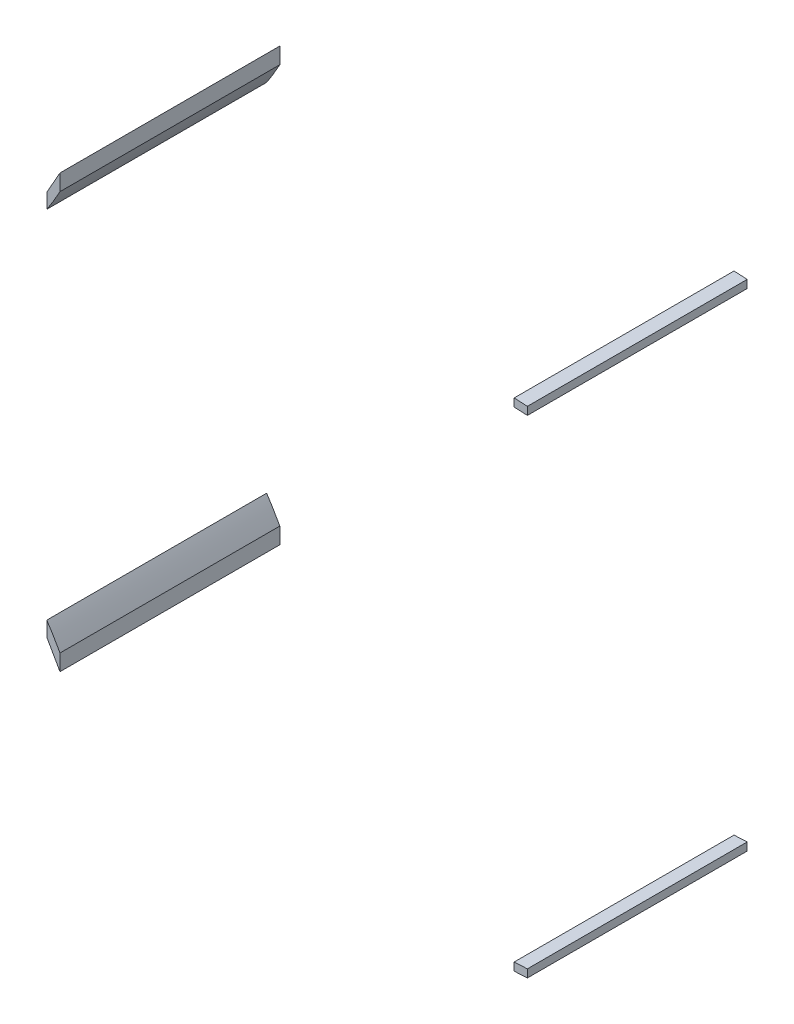
ISO-10303-21;
HEADER;
FILE_DESCRIPTION(('STEP AP214'),'2;1');
FILE_NAME('part.step','',(''),(''),'','','');
FILE_SCHEMA(('AUTOMOTIVE_DESIGN { 1 0 10303 214 1 1 1 1 }'));
ENDSEC;
DATA;
#1=APPLICATION_CONTEXT('core data for automotive mechanical design processes');
#2=APPLICATION_PROTOCOL_DEFINITION('international standard','automotive_design',2000,#1);
#3=PRODUCT_CONTEXT('',#1,'mechanical');
#4=PRODUCT('Part','Part','',(#3));
#5=PRODUCT_RELATED_PRODUCT_CATEGORY('part','',(#4));
#6=PRODUCT_DEFINITION_FORMATION('','',#4);
#7=PRODUCT_DEFINITION_CONTEXT('part definition',#1,'design');
#8=PRODUCT_DEFINITION('design','',#6,#7);
#9=PRODUCT_DEFINITION_SHAPE('','',#8);
#10=(LENGTH_UNIT() NAMED_UNIT(*) SI_UNIT(.MILLI.,.METRE.));
#11=(NAMED_UNIT(*) PLANE_ANGLE_UNIT() SI_UNIT($,.RADIAN.));
#12=(NAMED_UNIT(*) SI_UNIT($,.STERADIAN.) SOLID_ANGLE_UNIT());
#13=UNCERTAINTY_MEASURE_WITH_UNIT(LENGTH_MEASURE(1.E-05),#10,'distance_accuracy_value','');
#14=(GEOMETRIC_REPRESENTATION_CONTEXT(3) GLOBAL_UNCERTAINTY_ASSIGNED_CONTEXT((#13)) GLOBAL_UNIT_ASSIGNED_CONTEXT((#10,
#11,#12)) REPRESENTATION_CONTEXT('',''));
#15=CARTESIAN_POINT('',(0.,0.,0.));
#16=DIRECTION('',(0.,0.,1.));
#17=DIRECTION('',(1.,0.,0.));
#18=AXIS2_PLACEMENT_3D('',#15,#16,#17);
#19=CARTESIAN_POINT('',(-95.6973933556594,36.012725375374,50.));
#20=CARTESIAN_POINT('',(-94.6090631527935,37.6207513056427,50.));
#21=CARTESIAN_POINT('',(-93.6436176448856,39.3010213229673,50.));
#22=CARTESIAN_POINT('',(-92.6973933556596,40.9925915221107,50.));
#23=B_SPLINE_CURVE_WITH_KNOTS('',3,(#19,#20,#21,#22),.UNSPECIFIED.,.F.,.F.,(4,4),
(0.788966628989204,1.),.UNSPECIFIED.);
#24=DIRECTION('',(0.,0.,-1.));
#25=VECTOR('',#24,1.);
#26=SURFACE_OF_LINEAR_EXTRUSION('',#23,#25);
#27=CARTESIAN_POINT('',(-95.6973933556594,36.012725375374,0.));
#28=CARTESIAN_POINT('',(-94.6090631527935,37.6207513056427,0.));
#29=CARTESIAN_POINT('',(-93.6436176448856,39.3010213229673,0.));
#30=CARTESIAN_POINT('',(-92.6973933556596,40.9925915221107,0.));
#31=B_SPLINE_CURVE_WITH_KNOTS('',3,(#27,#28,#29,#30),.UNSPECIFIED.,.F.,.F.,(4,4),
(0.788966628989204,1.),.UNSPECIFIED.);
#32=CARTESIAN_POINT('',(-95.6973933556594,36.012725375374,0.));
#33=VERTEX_POINT('',#32);
#34=CARTESIAN_POINT('',(-92.6973933556596,40.9925915221107,0.));
#35=VERTEX_POINT('',#34);
#36=EDGE_CURVE('E206',#33,#35,#31,.T.);
#37=ORIENTED_EDGE('',*,*,#36,.T.);
#38=DIRECTION('',(0.,0.,-1.));
#39=VECTOR('',#38,1.);
#40=CARTESIAN_POINT('',(-92.6973933556596,40.9925915221107,50.));
#41=LINE('',#40,#39);
#42=CARTESIAN_POINT('',(-92.6973933556596,40.9925915221107,50.));
#43=VERTEX_POINT('',#42);
#44=EDGE_CURVE('E12',#43,#35,#41,.T.);
#45=ORIENTED_EDGE('',*,*,#44,.F.);
#46=CARTESIAN_POINT('',(-92.6973933556596,40.9925915221107,50.));
#47=CARTESIAN_POINT('',(-93.6436176448856,39.3010213229673,50.));
#48=CARTESIAN_POINT('',(-94.6090631527935,37.6207513056427,50.));
#49=CARTESIAN_POINT('',(-95.6973933556594,36.012725375374,50.));
#50=B_SPLINE_CURVE_WITH_KNOTS('',3,(#46,#47,#48,#49),.UNSPECIFIED.,.F.,.F.,(4,4),
(0.788966628989204,1.),.UNSPECIFIED.);
#51=CARTESIAN_POINT('',(-95.6973933556594,36.012725375374,50.));
#52=VERTEX_POINT('',#51);
#53=EDGE_CURVE('E107',#52,#43,#50,.F.);
#54=ORIENTED_EDGE('',*,*,#53,.F.);
#55=DIRECTION('',(0.,0.,-1.));
#56=VECTOR('',#55,1.);
#57=CARTESIAN_POINT('',(-95.6973933556594,36.012725375374,50.));
#58=LINE('',#57,#56);
#59=EDGE_CURVE('E192',#52,#33,#58,.T.);
#60=ORIENTED_EDGE('',*,*,#59,.T.);
#61=EDGE_LOOP('',(#37,#45,#54,#60));
#62=FACE_BOUND('',#61,.T.);
#63=ADVANCED_FACE('F48',(#62),#26,.F.);
#64=CARTESIAN_POINT('',(-92.6973933556596,40.9925915221107,50.));
#65=DIRECTION('',(-1.,-1.82555342158685E-09,0.));
#66=DIRECTION('',(1.82555342158685E-09,-1.,0.));
#67=AXIS2_PLACEMENT_3D('',#64,#65,#66);
#68=PLANE('',#67);
#69=DIRECTION('',(-1.82555342158685E-09,1.,0.));
#70=VECTOR('',#69,1.);
#71=CARTESIAN_POINT('',(-92.6973933556596,40.9925915221107,0.));
#72=LINE('',#71,#70);
#73=CARTESIAN_POINT('',(-92.6973933623901,44.6794290807303,0.));
#74=VERTEX_POINT('',#73);
#75=EDGE_CURVE('E112',#35,#74,#72,.T.);
#76=ORIENTED_EDGE('',*,*,#75,.T.);
#77=DIRECTION('',(0.,0.,-1.));
#78=VECTOR('',#77,1.);
#79=CARTESIAN_POINT('',(-92.6973933623901,44.6794290807303,50.));
#80=LINE('',#79,#78);
#81=CARTESIAN_POINT('',(-92.6973933623901,44.6794290807303,50.));
#82=VERTEX_POINT('',#81);
#83=EDGE_CURVE('E61',#82,#74,#80,.T.);
#84=ORIENTED_EDGE('',*,*,#83,.F.);
#85=DIRECTION('',(-1.82555342158685E-09,1.,0.));
#86=VECTOR('',#85,1.);
#87=CARTESIAN_POINT('',(-92.6973933556596,40.9925915221107,50.));
#88=LINE('',#87,#86);
#89=EDGE_CURVE('E101',#43,#82,#88,.T.);
#90=ORIENTED_EDGE('',*,*,#89,.F.);
#91=ORIENTED_EDGE('',*,*,#44,.T.);
#92=EDGE_LOOP('',(#76,#84,#90,#91));
#93=FACE_BOUND('',#92,.T.);
#94=ADVANCED_FACE('F111',(#93),#68,.F.);
#95=CARTESIAN_POINT('',(-92.6973933623901,44.6794290807303,50.));
#96=CARTESIAN_POINT('',(-93.7006562138489,42.9149075924535,50.));
#97=CARTESIAN_POINT('',(-94.6585660092315,41.1230685932505,50.));
#98=CARTESIAN_POINT('',(-95.6973933556594,39.3799686708825,50.));
#99=B_SPLINE_CURVE_WITH_KNOTS('',3,(#95,#96,#97,#98),.UNSPECIFIED.,.F.,.F.,(4,4),(0.,
0.230072601454776),.UNSPECIFIED.);
#100=DIRECTION('',(0.,0.,-1.));
#101=VECTOR('',#100,1.);
#102=SURFACE_OF_LINEAR_EXTRUSION('',#99,#101);
#103=CARTESIAN_POINT('',(-92.6973933623901,44.6794290807303,0.));
#104=CARTESIAN_POINT('',(-93.7006562138489,42.9149075924535,0.));
#105=CARTESIAN_POINT('',(-94.6585660092315,41.1230685932505,0.));
#106=CARTESIAN_POINT('',(-95.6973933556594,39.3799686708825,0.));
#107=B_SPLINE_CURVE_WITH_KNOTS('',3,(#103,#104,#105,#106),.UNSPECIFIED.,.F.,.F.,(4,4),(0.,
0.230072601454776),.UNSPECIFIED.);
#108=CARTESIAN_POINT('',(-95.6973933556594,39.3799686708825,0.));
#109=VERTEX_POINT('',#108);
#110=EDGE_CURVE('E87',#74,#109,#107,.T.);
#111=ORIENTED_EDGE('',*,*,#110,.T.);
#112=DIRECTION('',(0.,0.,-1.));
#113=VECTOR('',#112,1.);
#114=CARTESIAN_POINT('',(-95.6973933556594,39.3799686708825,50.));
#115=LINE('',#114,#113);
#116=CARTESIAN_POINT('',(-95.6973933556594,39.3799686708825,50.));
#117=VERTEX_POINT('',#116);
#118=EDGE_CURVE('E113',#117,#109,#115,.T.);
#119=ORIENTED_EDGE('',*,*,#118,.F.);
#120=CARTESIAN_POINT('',(-95.6973933556594,39.3799686708825,50.));
#121=CARTESIAN_POINT('',(-94.6585660092315,41.1230685932505,50.));
#122=CARTESIAN_POINT('',(-93.7006562138489,42.9149075924535,50.));
#123=CARTESIAN_POINT('',(-92.6973933623901,44.6794290807303,50.));
#124=B_SPLINE_CURVE_WITH_KNOTS('',3,(#120,#121,#122,#123),.UNSPECIFIED.,.F.,.F.,(4,4),(0.,
0.230072601454776),.UNSPECIFIED.);
#125=EDGE_CURVE('E104',#82,#117,#124,.F.);
#126=ORIENTED_EDGE('',*,*,#125,.F.);
#127=ORIENTED_EDGE('',*,*,#83,.T.);
#128=EDGE_LOOP('',(#111,#119,#126,#127));
#129=FACE_BOUND('',#128,.T.);
#130=ADVANCED_FACE('F116',(#129),#102,.F.);
#131=CARTESIAN_POINT('',(-95.6973933556594,36.012725375374,50.));
#132=DIRECTION('',(1.,0.,0.));
#133=DIRECTION('',(0.,0.,-1.));
#134=AXIS2_PLACEMENT_3D('',#131,#132,#133);
#135=PLANE('',#134);
#136=DIRECTION('',(0.,-1.,0.));
#137=VECTOR('',#136,1.);
#138=CARTESIAN_POINT('',(-95.6973933556594,36.012725375374,0.));
#139=LINE('',#138,#137);
#140=EDGE_CURVE('E94',#109,#33,#139,.T.);
#141=ORIENTED_EDGE('',*,*,#140,.T.);
#142=ORIENTED_EDGE('',*,*,#59,.F.);
#143=DIRECTION('',(0.,-1.,0.));
#144=VECTOR('',#143,1.);
#145=CARTESIAN_POINT('',(-95.6973933556594,36.012725375374,50.));
#146=LINE('',#145,#144);
#147=EDGE_CURVE('E70',#117,#52,#146,.T.);
#148=ORIENTED_EDGE('',*,*,#147,.F.);
#149=ORIENTED_EDGE('',*,*,#118,.T.);
#150=EDGE_LOOP('',(#141,#142,#148,#149));
#151=FACE_BOUND('',#150,.T.);
#152=ADVANCED_FACE('F135',(#151),#135,.F.);
#153=CARTESIAN_POINT('',(-94.1441036380445,38.4713293479143,50.));
#154=DIRECTION('',(0.,0.,1.));
#155=DIRECTION('',(1.,0.,0.));
#156=AXIS2_PLACEMENT_3D('',#153,#154,#155);
#157=PLANE('',#156);
#158=ORIENTED_EDGE('',*,*,#53,.T.);
#159=ORIENTED_EDGE('',*,*,#89,.T.);
#160=ORIENTED_EDGE('',*,*,#125,.T.);
#161=ORIENTED_EDGE('',*,*,#147,.T.);
#162=EDGE_LOOP('',(#158,#159,#160,#161));
#163=FACE_BOUND('',#162,.T.);
#164=ADVANCED_FACE('F102',(#163),#157,.T.);
#165=CARTESIAN_POINT('',(-94.1441036380445,38.4713293479143,0.));
#166=DIRECTION('',(0.,0.,1.));
#167=DIRECTION('',(1.,0.,0.));
#168=AXIS2_PLACEMENT_3D('',#165,#166,#167);
#169=PLANE('',#168);
#170=ORIENTED_EDGE('',*,*,#36,.F.);
#171=ORIENTED_EDGE('',*,*,#140,.F.);
#172=ORIENTED_EDGE('',*,*,#110,.F.);
#173=ORIENTED_EDGE('',*,*,#75,.F.);
#174=EDGE_LOOP('',(#170,#171,#172,#173));
#175=FACE_BOUND('',#174,.T.);
#176=ADVANCED_FACE('F165',(#175),#169,.F.);
#177=CLOSED_SHELL('',(#63,#94,#130,#152,#164,#176));
#178=MANIFOLD_SOLID_BREP('B2',#177);
#179=CARTESIAN_POINT('',(13.6026066350688,50.0581270496035,50.));
#180=DIRECTION('',(0.050479070854134,0.998725119042123,0.));
#181=DIRECTION('',(-0.998725119042123,0.050479070854134,0.));
#182=AXIS2_PLACEMENT_3D('',#179,#180,#181);
#183=PLANE('',#182);
#184=DIRECTION('',(0.998725119042123,-0.050479070854134,0.));
#185=VECTOR('',#184,1.);
#186=CARTESIAN_POINT('',(13.6026066350688,50.0581270496035,0.));
#187=LINE('',#186,#185);
#188=CARTESIAN_POINT('',(10.6026066350688,50.2097575730328,0.));
#189=VERTEX_POINT('',#188);
#190=CARTESIAN_POINT('',(13.6026066350688,50.0581270496035,0.));
#191=VERTEX_POINT('',#190);
#192=EDGE_CURVE('E351',#189,#191,#187,.T.);
#193=ORIENTED_EDGE('',*,*,#192,.T.);
#194=DIRECTION('',(0.,0.,-1.));
#195=VECTOR('',#194,1.);
#196=CARTESIAN_POINT('',(13.6026066350688,50.0581270496035,50.));
#197=LINE('',#196,#195);
#198=CARTESIAN_POINT('',(13.6026066350688,50.0581270496035,50.));
#199=VERTEX_POINT('',#198);
#200=EDGE_CURVE('E46',#199,#191,#197,.T.);
#201=ORIENTED_EDGE('',*,*,#200,.F.);
#202=DIRECTION('',(0.998725119042123,-0.050479070854134,0.));
#203=VECTOR('',#202,1.);
#204=CARTESIAN_POINT('',(13.6026066350688,50.0581270496035,50.));
#205=LINE('',#204,#203);
#206=CARTESIAN_POINT('',(10.6026066350688,50.2097575730328,50.));
#207=VERTEX_POINT('',#206);
#208=EDGE_CURVE('E339',#207,#199,#205,.T.);
#209=ORIENTED_EDGE('',*,*,#208,.F.);
#210=DIRECTION('',(0.,0.,-1.));
#211=VECTOR('',#210,1.);
#212=CARTESIAN_POINT('',(10.6026066350688,50.2097575730328,50.));
#213=LINE('',#212,#211);
#214=EDGE_CURVE('E347',#207,#189,#213,.T.);
#215=ORIENTED_EDGE('',*,*,#214,.T.);
#216=EDGE_LOOP('',(#193,#201,#209,#215));
#217=FACE_BOUND('',#216,.T.);
#218=ADVANCED_FACE('F288',(#217),#183,.F.);
#219=CARTESIAN_POINT('',(13.6026066350687,51.8604247646408,50.));
#220=DIRECTION('',(-1.,0.,0.));
#221=DIRECTION('',(0.,-1.,0.));
#222=AXIS2_PLACEMENT_3D('',#219,#220,#221);
#223=PLANE('',#222);
#224=DIRECTION('',(0.,1.,0.));
#225=VECTOR('',#224,1.);
#226=CARTESIAN_POINT('',(13.6026066350687,51.8604247646408,0.));
#227=LINE('',#226,#225);
#228=CARTESIAN_POINT('',(13.6026066350687,51.8604247646408,0.));
#229=VERTEX_POINT('',#228);
#230=EDGE_CURVE('E343',#191,#229,#227,.T.);
#231=ORIENTED_EDGE('',*,*,#230,.T.);
#232=DIRECTION('',(0.,0.,-1.));
#233=VECTOR('',#232,1.);
#234=CARTESIAN_POINT('',(13.6026066350687,51.8604247646408,50.));
#235=LINE('',#234,#233);
#236=CARTESIAN_POINT('',(13.6026066350687,51.8604247646408,50.));
#237=VERTEX_POINT('',#236);
#238=EDGE_CURVE('E296',#237,#229,#235,.T.);
#239=ORIENTED_EDGE('',*,*,#238,.F.);
#240=DIRECTION('',(0.,1.,0.));
#241=VECTOR('',#240,1.);
#242=CARTESIAN_POINT('',(13.6026066350687,51.8604247646408,50.));
#243=LINE('',#242,#241);
#244=EDGE_CURVE('E334',#199,#237,#243,.T.);
#245=ORIENTED_EDGE('',*,*,#244,.F.);
#246=ORIENTED_EDGE('',*,*,#200,.T.);
#247=EDGE_LOOP('',(#231,#239,#245,#246));
#248=FACE_BOUND('',#247,.T.);
#249=ADVANCED_FACE('F342',(#248),#223,.F.);
#250=CARTESIAN_POINT('',(10.6026066350686,52.0120552880701,50.));
#251=DIRECTION('',(-0.0504790708541331,-0.998725119042123,0.));
#252=DIRECTION('',(0.998725119042123,-0.0504790708541331,0.));
#253=AXIS2_PLACEMENT_3D('',#250,#251,#252);
#254=PLANE('',#253);
#255=DIRECTION('',(-0.998725119042123,0.0504790708541331,0.));
#256=VECTOR('',#255,1.);
#257=CARTESIAN_POINT('',(10.6026066350686,52.0120552880701,0.));
#258=LINE('',#257,#256);
#259=CARTESIAN_POINT('',(10.6026066350686,52.0120552880701,0.));
#260=VERTEX_POINT('',#259);
#261=EDGE_CURVE('E321',#229,#260,#258,.T.);
#262=ORIENTED_EDGE('',*,*,#261,.T.);
#263=DIRECTION('',(0.,0.,-1.));
#264=VECTOR('',#263,1.);
#265=CARTESIAN_POINT('',(10.6026066350686,52.0120552880701,50.));
#266=LINE('',#265,#264);
#267=CARTESIAN_POINT('',(10.6026066350686,52.0120552880701,50.));
#268=VERTEX_POINT('',#267);
#269=EDGE_CURVE('E344',#268,#260,#266,.T.);
#270=ORIENTED_EDGE('',*,*,#269,.F.);
#271=DIRECTION('',(-0.998725119042123,0.0504790708541331,0.));
#272=VECTOR('',#271,1.);
#273=CARTESIAN_POINT('',(10.6026066350686,52.0120552880701,50.));
#274=LINE('',#273,#272);
#275=EDGE_CURVE('E337',#237,#268,#274,.T.);
#276=ORIENTED_EDGE('',*,*,#275,.F.);
#277=ORIENTED_EDGE('',*,*,#238,.T.);
#278=EDGE_LOOP('',(#262,#270,#276,#277));
#279=FACE_BOUND('',#278,.T.);
#280=ADVANCED_FACE('F345',(#279),#254,.F.);
#281=CARTESIAN_POINT('',(10.6026066350688,50.2097575730328,50.));
#282=DIRECTION('',(1.,0.,0.));
#283=DIRECTION('',(0.,1.,0.));
#284=AXIS2_PLACEMENT_3D('',#281,#282,#283);
#285=PLANE('',#284);
#286=DIRECTION('',(0.,-1.,0.));
#287=VECTOR('',#286,1.);
#288=CARTESIAN_POINT('',(10.6026066350688,50.2097575730328,0.));
#289=LINE('',#288,#287);
#290=EDGE_CURVE('E327',#260,#189,#289,.T.);
#291=ORIENTED_EDGE('',*,*,#290,.T.);
#292=ORIENTED_EDGE('',*,*,#214,.F.);
#293=DIRECTION('',(0.,-1.,0.));
#294=VECTOR('',#293,1.);
#295=CARTESIAN_POINT('',(10.6026066350688,50.2097575730328,50.));
#296=LINE('',#295,#294);
#297=EDGE_CURVE('E304',#268,#207,#296,.T.);
#298=ORIENTED_EDGE('',*,*,#297,.F.);
#299=ORIENTED_EDGE('',*,*,#269,.T.);
#300=EDGE_LOOP('',(#291,#292,#298,#299));
#301=FACE_BOUND('',#300,.T.);
#302=ADVANCED_FACE('F358',(#301),#285,.F.);
#303=CARTESIAN_POINT('',(0.,0.,50.));
#304=DIRECTION('',(0.,0.,-1.));
#305=DIRECTION('',(-1.,0.,0.));
#306=AXIS2_PLACEMENT_3D('',#303,#304,#305);
#307=PLANE('',#306);
#308=ORIENTED_EDGE('',*,*,#208,.T.);
#309=ORIENTED_EDGE('',*,*,#244,.T.);
#310=ORIENTED_EDGE('',*,*,#275,.T.);
#311=ORIENTED_EDGE('',*,*,#297,.T.);
#312=EDGE_LOOP('',(#308,#309,#310,#311));
#313=FACE_BOUND('',#312,.T.);
#314=ADVANCED_FACE('F335',(#313),#307,.F.);
#315=CARTESIAN_POINT('',(0.,0.,0.));
#316=DIRECTION('',(0.,0.,-1.));
#317=DIRECTION('',(-1.,0.,0.));
#318=AXIS2_PLACEMENT_3D('',#315,#316,#317);
#319=PLANE('',#318);
#320=ORIENTED_EDGE('',*,*,#192,.F.);
#321=ORIENTED_EDGE('',*,*,#290,.F.);
#322=ORIENTED_EDGE('',*,*,#261,.F.);
#323=ORIENTED_EDGE('',*,*,#230,.F.);
#324=EDGE_LOOP('',(#320,#321,#322,#323));
#325=FACE_BOUND('',#324,.T.);
#326=ADVANCED_FACE('F361',(#325),#319,.T.);
#327=CLOSED_SHELL('',(#218,#249,#280,#302,#314,#326));
#328=MANIFOLD_SOLID_BREP('B6',#327);
#329=CARTESIAN_POINT('',(13.6026066350711,-58.9443829737683,50.));
#330=DIRECTION('',(0.0504790708541734,-0.998725119042121,0.));
#331=DIRECTION('',(0.998725119042121,0.0504790708541734,0.));
#332=AXIS2_PLACEMENT_3D('',#329,#330,#331);
#333=PLANE('',#332);
#334=DIRECTION('',(-0.998725119042121,-0.0504790708541734,0.));
#335=VECTOR('',#334,1.);
#336=CARTESIAN_POINT('',(13.6026066350711,-58.9443829737683,0.));
#337=LINE('',#336,#335);
#338=CARTESIAN_POINT('',(13.6026066350711,-58.9443829737683,0.));
#339=VERTEX_POINT('',#338);
#340=CARTESIAN_POINT('',(10.6026066350711,-59.0960134971978,0.));
#341=VERTEX_POINT('',#340);
#342=EDGE_CURVE('E484',#339,#341,#337,.T.);
#343=ORIENTED_EDGE('',*,*,#342,.T.);
#344=DIRECTION('',(0.,0.,-1.));
#345=VECTOR('',#344,1.);
#346=CARTESIAN_POINT('',(10.6026066350711,-59.0960134971978,50.));
#347=LINE('',#346,#345);
#348=CARTESIAN_POINT('',(10.6026066350711,-59.0960134971978,50.));
#349=VERTEX_POINT('',#348);
#350=EDGE_CURVE('E286',#349,#341,#347,.T.);
#351=ORIENTED_EDGE('',*,*,#350,.F.);
#352=DIRECTION('',(-0.998725119042121,-0.0504790708541734,0.));
#353=VECTOR('',#352,1.);
#354=CARTESIAN_POINT('',(13.6026066350711,-58.9443829737683,50.));
#355=LINE('',#354,#353);
#356=CARTESIAN_POINT('',(13.6026066350711,-58.9443829737683,50.));
#357=VERTEX_POINT('',#356);
#358=EDGE_CURVE('E472',#357,#349,#355,.T.);
#359=ORIENTED_EDGE('',*,*,#358,.F.);
#360=DIRECTION('',(0.,0.,-1.));
#361=VECTOR('',#360,1.);
#362=CARTESIAN_POINT('',(13.6026066350711,-58.9443829737683,50.));
#363=LINE('',#362,#361);
#364=EDGE_CURVE('E480',#357,#339,#363,.T.);
#365=ORIENTED_EDGE('',*,*,#364,.T.);
#366=EDGE_LOOP('',(#343,#351,#359,#365));
#367=FACE_BOUND('',#366,.T.);
#368=ADVANCED_FACE('F421',(#367),#333,.F.);
#369=CARTESIAN_POINT('',(10.6026066350711,-59.0960134971978,50.));
#370=DIRECTION('',(1.,0.,0.));
#371=DIRECTION('',(0.,1.,0.));
#372=AXIS2_PLACEMENT_3D('',#369,#370,#371);
#373=PLANE('',#372);
#374=DIRECTION('',(0.,-1.,0.));
#375=VECTOR('',#374,1.);
#376=CARTESIAN_POINT('',(10.6026066350711,-59.0960134971978,0.));
#377=LINE('',#376,#375);
#378=CARTESIAN_POINT('',(10.6026066350711,-60.8983112122351,0.));
#379=VERTEX_POINT('',#378);
#380=EDGE_CURVE('E476',#341,#379,#377,.T.);
#381=ORIENTED_EDGE('',*,*,#380,.T.);
#382=DIRECTION('',(0.,0.,-1.));
#383=VECTOR('',#382,1.);
#384=CARTESIAN_POINT('',(10.6026066350711,-60.8983112122351,50.));
#385=LINE('',#384,#383);
#386=CARTESIAN_POINT('',(10.6026066350711,-60.8983112122351,50.));
#387=VERTEX_POINT('',#386);
#388=EDGE_CURVE('E429',#387,#379,#385,.T.);
#389=ORIENTED_EDGE('',*,*,#388,.F.);
#390=DIRECTION('',(0.,-1.,0.));
#391=VECTOR('',#390,1.);
#392=CARTESIAN_POINT('',(10.6026066350711,-59.0960134971978,50.));
#393=LINE('',#392,#391);
#394=EDGE_CURVE('E467',#349,#387,#393,.T.);
#395=ORIENTED_EDGE('',*,*,#394,.F.);
#396=ORIENTED_EDGE('',*,*,#350,.T.);
#397=EDGE_LOOP('',(#381,#389,#395,#396));
#398=FACE_BOUND('',#397,.T.);
#399=ADVANCED_FACE('F475',(#398),#373,.F.);
#400=CARTESIAN_POINT('',(10.6026066350711,-60.8983112122351,50.));
#401=DIRECTION('',(-0.0504790708541755,0.998725119042121,0.));
#402=DIRECTION('',(-0.998725119042121,-0.0504790708541755,0.));
#403=AXIS2_PLACEMENT_3D('',#400,#401,#402);
#404=PLANE('',#403);
#405=DIRECTION('',(0.998725119042121,0.0504790708541755,0.));
#406=VECTOR('',#405,1.);
#407=CARTESIAN_POINT('',(10.6026066350711,-60.8983112122351,0.));
#408=LINE('',#407,#406);
#409=CARTESIAN_POINT('',(13.6026066350711,-60.7466806888056,0.));
#410=VERTEX_POINT('',#409);
#411=EDGE_CURVE('E454',#379,#410,#408,.T.);
#412=ORIENTED_EDGE('',*,*,#411,.T.);
#413=DIRECTION('',(0.,0.,-1.));
#414=VECTOR('',#413,1.);
#415=CARTESIAN_POINT('',(13.6026066350711,-60.7466806888056,50.));
#416=LINE('',#415,#414);
#417=CARTESIAN_POINT('',(13.6026066350711,-60.7466806888056,50.));
#418=VERTEX_POINT('',#417);
#419=EDGE_CURVE('E477',#418,#410,#416,.T.);
#420=ORIENTED_EDGE('',*,*,#419,.F.);
#421=DIRECTION('',(0.998725119042121,0.0504790708541755,0.));
#422=VECTOR('',#421,1.);
#423=CARTESIAN_POINT('',(10.6026066350711,-60.8983112122351,50.));
#424=LINE('',#423,#422);
#425=EDGE_CURVE('E470',#387,#418,#424,.T.);
#426=ORIENTED_EDGE('',*,*,#425,.F.);
#427=ORIENTED_EDGE('',*,*,#388,.T.);
#428=EDGE_LOOP('',(#412,#420,#426,#427));
#429=FACE_BOUND('',#428,.T.);
#430=ADVANCED_FACE('F478',(#429),#404,.F.);
#431=CARTESIAN_POINT('',(13.6026066350711,-60.7466806888056,50.));
#432=DIRECTION('',(-1.,0.,0.));
#433=DIRECTION('',(0.,-1.,0.));
#434=AXIS2_PLACEMENT_3D('',#431,#432,#433);
#435=PLANE('',#434);
#436=DIRECTION('',(0.,1.,0.));
#437=VECTOR('',#436,1.);
#438=CARTESIAN_POINT('',(13.6026066350711,-60.7466806888056,0.));
#439=LINE('',#438,#437);
#440=EDGE_CURVE('E460',#410,#339,#439,.T.);
#441=ORIENTED_EDGE('',*,*,#440,.T.);
#442=ORIENTED_EDGE('',*,*,#364,.F.);
#443=DIRECTION('',(0.,1.,0.));
#444=VECTOR('',#443,1.);
#445=CARTESIAN_POINT('',(13.6026066350711,-60.7466806888056,50.));
#446=LINE('',#445,#444);
#447=EDGE_CURVE('E437',#418,#357,#446,.T.);
#448=ORIENTED_EDGE('',*,*,#447,.F.);
#449=ORIENTED_EDGE('',*,*,#419,.T.);
#450=EDGE_LOOP('',(#441,#442,#448,#449));
#451=FACE_BOUND('',#450,.T.);
#452=ADVANCED_FACE('F491',(#451),#435,.F.);
#453=CARTESIAN_POINT('',(0.,0.,50.));
#454=DIRECTION('',(0.,0.,1.));
#455=DIRECTION('',(1.,0.,0.));
#456=AXIS2_PLACEMENT_3D('',#453,#454,#455);
#457=PLANE('',#456);
#458=ORIENTED_EDGE('',*,*,#358,.T.);
#459=ORIENTED_EDGE('',*,*,#394,.T.);
#460=ORIENTED_EDGE('',*,*,#425,.T.);
#461=ORIENTED_EDGE('',*,*,#447,.T.);
#462=EDGE_LOOP('',(#458,#459,#460,#461));
#463=FACE_BOUND('',#462,.T.);
#464=ADVANCED_FACE('F468',(#463),#457,.T.);
#465=CARTESIAN_POINT('',(0.,0.,0.));
#466=DIRECTION('',(0.,0.,1.));
#467=DIRECTION('',(1.,0.,0.));
#468=AXIS2_PLACEMENT_3D('',#465,#466,#467);
#469=PLANE('',#468);
#470=ORIENTED_EDGE('',*,*,#342,.F.);
#471=ORIENTED_EDGE('',*,*,#440,.F.);
#472=ORIENTED_EDGE('',*,*,#411,.F.);
#473=ORIENTED_EDGE('',*,*,#380,.F.);
#474=EDGE_LOOP('',(#470,#471,#472,#473));
#475=FACE_BOUND('',#474,.T.);
#476=ADVANCED_FACE('F494',(#475),#469,.F.);
#477=CLOSED_SHELL('',(#368,#399,#430,#452,#464,#476));
#478=MANIFOLD_SOLID_BREP('B40',#477);
#479=CARTESIAN_POINT('',(-92.6973933556577,-49.8788474462801,50.));
#480=CARTESIAN_POINT('',(-93.6436176448837,-48.1872772471367,50.));
#481=CARTESIAN_POINT('',(-94.6090631527917,-46.5070072298122,50.));
#482=CARTESIAN_POINT('',(-95.6973933556577,-44.8989812995435,50.));
#483=B_SPLINE_CURVE_WITH_KNOTS('',3,(#479,#480,#481,#482),.UNSPECIFIED.,.F.,.F.,(4,4),
(0.788966628989204,1.),.UNSPECIFIED.);
#484=DIRECTION('',(0.,0.,-1.));
#485=VECTOR('',#484,1.);
#486=SURFACE_OF_LINEAR_EXTRUSION('',#483,#485);
#487=CARTESIAN_POINT('',(-92.6973933556577,-49.8788474462801,0.));
#488=CARTESIAN_POINT('',(-93.6436176448837,-48.1872772471367,0.));
#489=CARTESIAN_POINT('',(-94.6090631527917,-46.5070072298122,0.));
#490=CARTESIAN_POINT('',(-95.6973933556577,-44.8989812995435,0.));
#491=B_SPLINE_CURVE_WITH_KNOTS('',3,(#487,#488,#489,#490),.UNSPECIFIED.,.F.,.F.,(4,4),
(0.788966628989204,1.),.UNSPECIFIED.);
#492=CARTESIAN_POINT('',(-92.6973933556576,-49.8788474462801,0.));
#493=VERTEX_POINT('',#492);
#494=CARTESIAN_POINT('',(-95.6973933556577,-44.8989812995435,0.));
#495=VERTEX_POINT('',#494);
#496=EDGE_CURVE('E703',#493,#495,#491,.T.);
#497=ORIENTED_EDGE('',*,*,#496,.T.);
#498=DIRECTION('',(0.,0.,-1.));
#499=VECTOR('',#498,1.);
#500=CARTESIAN_POINT('',(-95.6973933556577,-44.8989812995435,50.));
#501=LINE('',#500,#499);
#502=CARTESIAN_POINT('',(-95.6973933556577,-44.8989812995435,50.));
#503=VERTEX_POINT('',#502);
#504=EDGE_CURVE('E419',#503,#495,#501,.T.);
#505=ORIENTED_EDGE('',*,*,#504,.F.);
#506=CARTESIAN_POINT('',(-95.6973933556577,-44.8989812995435,50.));
#507=CARTESIAN_POINT('',(-94.6090631527917,-46.5070072298122,50.));
#508=CARTESIAN_POINT('',(-93.6436176448837,-48.1872772471367,50.));
#509=CARTESIAN_POINT('',(-92.6973933556577,-49.8788474462801,50.));
#510=B_SPLINE_CURVE_WITH_KNOTS('',3,(#506,#507,#508,#509),.UNSPECIFIED.,.F.,.F.,(4,4),
(0.788966628989204,1.),.UNSPECIFIED.);
#511=CARTESIAN_POINT('',(-92.6973933556576,-49.8788474462801,50.));
#512=VERTEX_POINT('',#511);
#513=EDGE_CURVE('E604',#512,#503,#510,.F.);
#514=ORIENTED_EDGE('',*,*,#513,.F.);
#515=DIRECTION('',(0.,0.,-1.));
#516=VECTOR('',#515,1.);
#517=CARTESIAN_POINT('',(-92.6973933556576,-49.8788474462801,50.));
#518=LINE('',#517,#516);
#519=EDGE_CURVE('E689',#512,#493,#518,.T.);
#520=ORIENTED_EDGE('',*,*,#519,.T.);
#521=EDGE_LOOP('',(#497,#505,#514,#520));
#522=FACE_BOUND('',#521,.T.);
#523=ADVANCED_FACE('F545',(#522),#486,.F.);
#524=CARTESIAN_POINT('',(-95.6973933556577,-44.8989812995435,50.));
#525=DIRECTION('',(1.,0.,0.));
#526=DIRECTION('',(0.,0.,-1.));
#527=AXIS2_PLACEMENT_3D('',#524,#525,#526);
#528=PLANE('',#527);
#529=DIRECTION('',(0.,-1.,0.));
#530=VECTOR('',#529,1.);
#531=CARTESIAN_POINT('',(-95.6973933556577,-44.8989812995435,0.));
#532=LINE('',#531,#530);
#533=CARTESIAN_POINT('',(-95.6973933556577,-48.266224595052,0.));
#534=VERTEX_POINT('',#533);
#535=EDGE_CURVE('E609',#495,#534,#532,.T.);
#536=ORIENTED_EDGE('',*,*,#535,.T.);
#537=DIRECTION('',(0.,0.,-1.));
#538=VECTOR('',#537,1.);
#539=CARTESIAN_POINT('',(-95.6973933556577,-48.266224595052,50.));
#540=LINE('',#539,#538);
#541=CARTESIAN_POINT('',(-95.6973933556577,-48.266224595052,50.));
#542=VERTEX_POINT('',#541);
#543=EDGE_CURVE('E558',#542,#534,#540,.T.);
#544=ORIENTED_EDGE('',*,*,#543,.F.);
#545=DIRECTION('',(0.,-1.,0.));
#546=VECTOR('',#545,1.);
#547=CARTESIAN_POINT('',(-95.6973933556577,-44.8989812995435,50.));
#548=LINE('',#547,#546);
#549=EDGE_CURVE('E598',#503,#542,#548,.T.);
#550=ORIENTED_EDGE('',*,*,#549,.F.);
#551=ORIENTED_EDGE('',*,*,#504,.T.);
#552=EDGE_LOOP('',(#536,#544,#550,#551));
#553=FACE_BOUND('',#552,.T.);
#554=ADVANCED_FACE('F608',(#553),#528,.F.);
#555=CARTESIAN_POINT('',(-95.6973933556577,-48.266224595052,50.));
#556=CARTESIAN_POINT('',(-94.6585660070159,-50.0093245161006,50.));
#557=CARTESIAN_POINT('',(-93.7006562093575,-51.801163514087,50.));
#558=CARTESIAN_POINT('',(-92.6973933556576,-53.5656850010896,50.));
#559=B_SPLINE_CURVE_WITH_KNOTS('',3,(#555,#556,#557,#558),.UNSPECIFIED.,.F.,.F.,(4,4),(0.,
0.230072601454776),.UNSPECIFIED.);
#560=DIRECTION('',(0.,0.,-1.));
#561=VECTOR('',#560,1.);
#562=SURFACE_OF_LINEAR_EXTRUSION('',#559,#561);
#563=CARTESIAN_POINT('',(-95.6973933556577,-48.266224595052,0.));
#564=CARTESIAN_POINT('',(-94.6585660070159,-50.0093245161006,0.));
#565=CARTESIAN_POINT('',(-93.7006562093575,-51.801163514087,0.));
#566=CARTESIAN_POINT('',(-92.6973933556576,-53.5656850010896,0.));
#567=B_SPLINE_CURVE_WITH_KNOTS('',3,(#563,#564,#565,#566),.UNSPECIFIED.,.F.,.F.,(4,4),(0.,
0.230072601454776),.UNSPECIFIED.);
#568=CARTESIAN_POINT('',(-92.6973933556576,-53.5656850010896,0.));
#569=VERTEX_POINT('',#568);
#570=EDGE_CURVE('E584',#534,#569,#567,.T.);
#571=ORIENTED_EDGE('',*,*,#570,.T.);
#572=DIRECTION('',(0.,0.,-1.));
#573=VECTOR('',#572,1.);
#574=CARTESIAN_POINT('',(-92.6973933556576,-53.5656850010896,50.));
#575=LINE('',#574,#573);
#576=CARTESIAN_POINT('',(-92.6973933556576,-53.5656850010896,50.));
#577=VERTEX_POINT('',#576);
#578=EDGE_CURVE('E610',#577,#569,#575,.T.);
#579=ORIENTED_EDGE('',*,*,#578,.F.);
#580=CARTESIAN_POINT('',(-92.6973933556576,-53.5656850010896,50.));
#581=CARTESIAN_POINT('',(-93.7006562093575,-51.801163514087,50.));
#582=CARTESIAN_POINT('',(-94.6585660070159,-50.0093245161006,50.));
#583=CARTESIAN_POINT('',(-95.6973933556577,-48.266224595052,50.));
#584=B_SPLINE_CURVE_WITH_KNOTS('',3,(#580,#581,#582,#583),.UNSPECIFIED.,.F.,.F.,(4,4),(0.,
0.230072601454776),.UNSPECIFIED.);
#585=EDGE_CURVE('E601',#542,#577,#584,.F.);
#586=ORIENTED_EDGE('',*,*,#585,.F.);
#587=ORIENTED_EDGE('',*,*,#543,.T.);
#588=EDGE_LOOP('',(#571,#579,#586,#587));
#589=FACE_BOUND('',#588,.T.);
#590=ADVANCED_FACE('F613',(#589),#562,.F.);
#591=CARTESIAN_POINT('',(-92.6973933556576,-49.8788474462801,50.));
#592=DIRECTION('',(-1.,0.,0.));
#593=DIRECTION('',(0.,0.,1.));
#594=AXIS2_PLACEMENT_3D('',#591,#592,#593);
#595=PLANE('',#594);
#596=DIRECTION('',(0.,1.,0.));
#597=VECTOR('',#596,1.);
#598=CARTESIAN_POINT('',(-92.6973933556576,-49.8788474462801,0.));
#599=LINE('',#598,#597);
#600=EDGE_CURVE('E591',#569,#493,#599,.T.);
#601=ORIENTED_EDGE('',*,*,#600,.T.);
#602=ORIENTED_EDGE('',*,*,#519,.F.);
#603=DIRECTION('',(0.,1.,0.));
#604=VECTOR('',#603,1.);
#605=CARTESIAN_POINT('',(-92.6973933556576,-49.8788474462801,50.));
#606=LINE('',#605,#604);
#607=EDGE_CURVE('E567',#577,#512,#606,.T.);
#608=ORIENTED_EDGE('',*,*,#607,.F.);
#609=ORIENTED_EDGE('',*,*,#578,.T.);
#610=EDGE_LOOP('',(#601,#602,#608,#609));
#611=FACE_BOUND('',#610,.T.);
#612=ADVANCED_FACE('F632',(#611),#595,.F.);
#613=CARTESIAN_POINT('',(-94.1441036380427,-47.3575852720838,50.));
#614=DIRECTION('',(0.,0.,-1.));
#615=DIRECTION('',(-1.,0.,0.));
#616=AXIS2_PLACEMENT_3D('',#613,#614,#615);
#617=PLANE('',#616);
#618=ORIENTED_EDGE('',*,*,#513,.T.);
#619=ORIENTED_EDGE('',*,*,#549,.T.);
#620=ORIENTED_EDGE('',*,*,#585,.T.);
#621=ORIENTED_EDGE('',*,*,#607,.T.);
#622=EDGE_LOOP('',(#618,#619,#620,#621));
#623=FACE_BOUND('',#622,.T.);
#624=ADVANCED_FACE('F599',(#623),#617,.F.);
#625=CARTESIAN_POINT('',(-94.1441036380427,-47.3575852720838,0.));
#626=DIRECTION('',(0.,0.,-1.));
#627=DIRECTION('',(-1.,0.,0.));
#628=AXIS2_PLACEMENT_3D('',#625,#626,#627);
#629=PLANE('',#628);
#630=ORIENTED_EDGE('',*,*,#496,.F.);
#631=ORIENTED_EDGE('',*,*,#600,.F.);
#632=ORIENTED_EDGE('',*,*,#570,.F.);
#633=ORIENTED_EDGE('',*,*,#535,.F.);
#634=EDGE_LOOP('',(#630,#631,#632,#633));
#635=FACE_BOUND('',#634,.T.);
#636=ADVANCED_FACE('F662',(#635),#629,.T.);
#637=CLOSED_SHELL('',(#523,#554,#590,#612,#624,#636));
#638=MANIFOLD_SOLID_BREP('B280',#637);
#639=ADVANCED_BREP_SHAPE_REPRESENTATION('',(#18,#178,#328,#478,#638),#14);
#640=SHAPE_DEFINITION_REPRESENTATION(#9,#639);
ENDSEC;
END-ISO-10303-21;
